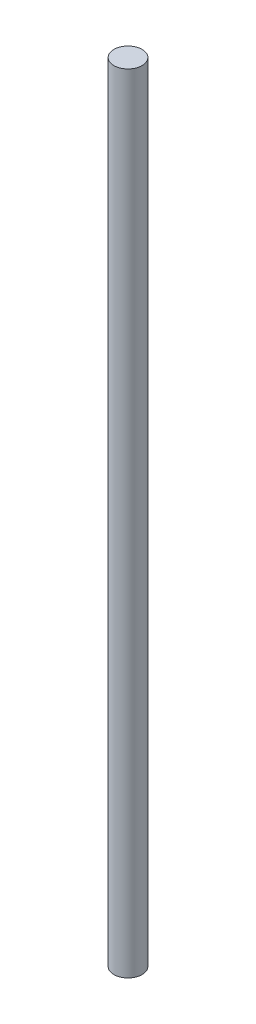
ISO-10303-21;
HEADER;
FILE_DESCRIPTION(('STEP AP214'),'2;1');
FILE_NAME('part.step','',(''),(''),'','','');
FILE_SCHEMA(('AUTOMOTIVE_DESIGN { 1 0 10303 214 1 1 1 1 }'));
ENDSEC;
DATA;
#1=APPLICATION_CONTEXT('core data for automotive mechanical design processes');
#2=APPLICATION_PROTOCOL_DEFINITION('international standard','automotive_design',2000,#1);
#3=PRODUCT_CONTEXT('',#1,'mechanical');
#4=PRODUCT('Part','Part','',(#3));
#5=PRODUCT_RELATED_PRODUCT_CATEGORY('part','',(#4));
#6=PRODUCT_DEFINITION_FORMATION('','',#4);
#7=PRODUCT_DEFINITION_CONTEXT('part definition',#1,'design');
#8=PRODUCT_DEFINITION('design','',#6,#7);
#9=PRODUCT_DEFINITION_SHAPE('','',#8);
#10=(LENGTH_UNIT() NAMED_UNIT(*) SI_UNIT(.MILLI.,.METRE.));
#11=(NAMED_UNIT(*) PLANE_ANGLE_UNIT() SI_UNIT($,.RADIAN.));
#12=(NAMED_UNIT(*) SI_UNIT($,.STERADIAN.) SOLID_ANGLE_UNIT());
#13=UNCERTAINTY_MEASURE_WITH_UNIT(LENGTH_MEASURE(1.E-05),#10,'distance_accuracy_value','');
#14=(GEOMETRIC_REPRESENTATION_CONTEXT(3) GLOBAL_UNCERTAINTY_ASSIGNED_CONTEXT((#13)) GLOBAL_UNIT_ASSIGNED_CONTEXT((#10,
#11,#12)) REPRESENTATION_CONTEXT('',''));
#15=CARTESIAN_POINT('',(0.,0.,0.));
#16=DIRECTION('',(0.,0.,1.));
#17=DIRECTION('',(1.,0.,0.));
#18=AXIS2_PLACEMENT_3D('',#15,#16,#17);
#19=CARTESIAN_POINT('',(0.,88.9,0.));
#20=DIRECTION('',(0.,-1.,0.));
#21=DIRECTION('',(0.,0.,-1.));
#22=AXIS2_PLACEMENT_3D('',#19,#20,#21);
#23=CYLINDRICAL_SURFACE('',#22,3.175);
#24=CARTESIAN_POINT('',(0.,88.9,0.));
#25=DIRECTION('',(0.,1.,0.));
#26=DIRECTION('',(0.,0.,1.));
#27=AXIS2_PLACEMENT_3D('',#24,#25,#26);
#28=CIRCLE('',#27,3.175);
#29=CARTESIAN_POINT('',(0.,88.9,3.175));
#30=VERTEX_POINT('',#29);
#31=EDGE_CURVE('E12',#30,#30,#28,.T.);
#32=ORIENTED_EDGE('',*,*,#31,.F.);
#33=EDGE_LOOP('',(#32));
#34=FACE_BOUND('',#33,.T.);
#35=CARTESIAN_POINT('',(0.,-88.9,0.));
#36=DIRECTION('',(0.,1.,0.));
#37=DIRECTION('',(0.,0.,1.));
#38=AXIS2_PLACEMENT_3D('',#35,#36,#37);
#39=CIRCLE('',#38,3.175);
#40=CARTESIAN_POINT('',(0.,-88.9,3.175));
#41=VERTEX_POINT('',#40);
#42=EDGE_CURVE('E43',#41,#41,#39,.T.);
#43=ORIENTED_EDGE('',*,*,#42,.T.);
#44=EDGE_LOOP('',(#43));
#45=FACE_BOUND('',#44,.T.);
#46=ADVANCED_FACE('F40',(#34,#45),#23,.T.);
#47=CARTESIAN_POINT('',(0.,88.9,0.));
#48=DIRECTION('',(0.,1.,0.));
#49=DIRECTION('',(0.,0.,1.));
#50=AXIS2_PLACEMENT_3D('',#47,#48,#49);
#51=PLANE('',#50);
#52=ORIENTED_EDGE('',*,*,#31,.T.);
#53=EDGE_LOOP('',(#52));
#54=FACE_BOUND('',#53,.T.);
#55=ADVANCED_FACE('F55',(#54),#51,.T.);
#56=CARTESIAN_POINT('',(0.,-88.9,0.));
#57=DIRECTION('',(0.,1.,0.));
#58=DIRECTION('',(0.,0.,1.));
#59=AXIS2_PLACEMENT_3D('',#56,#57,#58);
#60=PLANE('',#59);
#61=ORIENTED_EDGE('',*,*,#42,.F.);
#62=EDGE_LOOP('',(#61));
#63=FACE_BOUND('',#62,.T.);
#64=ADVANCED_FACE('F53',(#63),#60,.F.);
#65=CLOSED_SHELL('',(#46,#55,#64));
#66=MANIFOLD_SOLID_BREP('B2',#65);
#67=ADVANCED_BREP_SHAPE_REPRESENTATION('',(#18,#66),#14);
#68=SHAPE_DEFINITION_REPRESENTATION(#9,#67);
ENDSEC;
END-ISO-10303-21;
